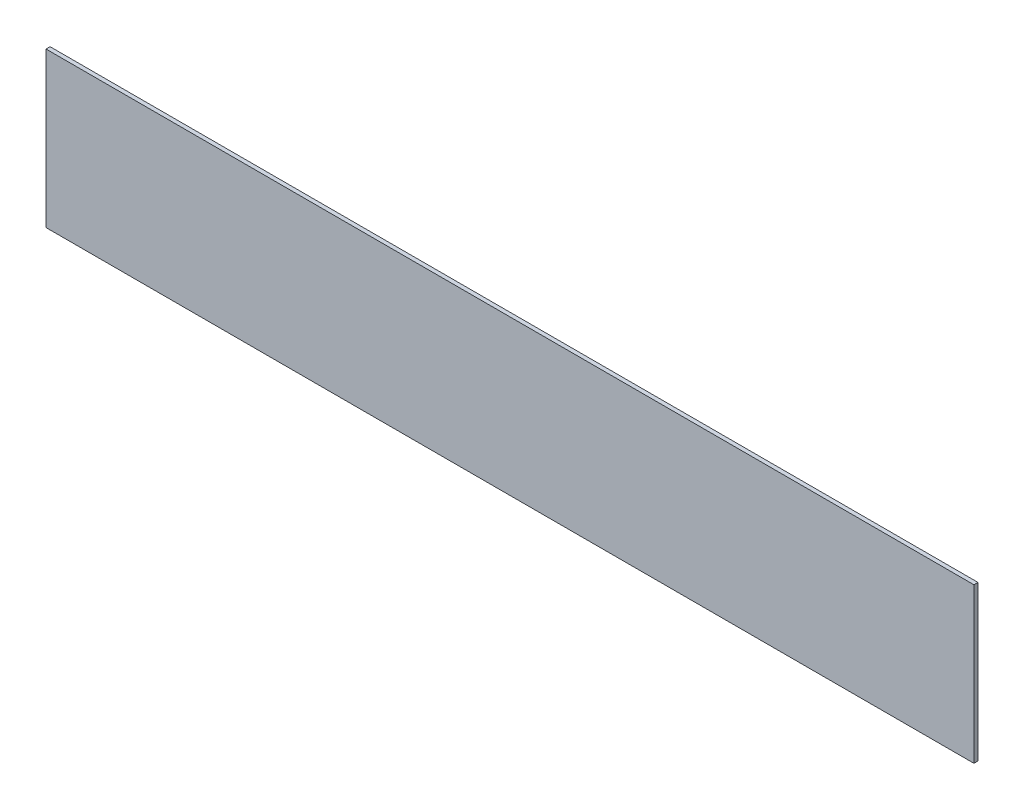
ISO-10303-21;
HEADER;
FILE_DESCRIPTION(('STEP AP214'),'2;1');
FILE_NAME('part.step','',(''),(''),'','','');
FILE_SCHEMA(('AUTOMOTIVE_DESIGN { 1 0 10303 214 1 1 1 1 }'));
ENDSEC;
DATA;
#1=APPLICATION_CONTEXT('core data for automotive mechanical design processes');
#2=APPLICATION_PROTOCOL_DEFINITION('international standard','automotive_design',2000,#1);
#3=PRODUCT_CONTEXT('',#1,'mechanical');
#4=PRODUCT('Part','Part','',(#3));
#5=PRODUCT_RELATED_PRODUCT_CATEGORY('part','',(#4));
#6=PRODUCT_DEFINITION_FORMATION('','',#4);
#7=PRODUCT_DEFINITION_CONTEXT('part definition',#1,'design');
#8=PRODUCT_DEFINITION('design','',#6,#7);
#9=PRODUCT_DEFINITION_SHAPE('','',#8);
#10=(LENGTH_UNIT() NAMED_UNIT(*) SI_UNIT(.MILLI.,.METRE.));
#11=(NAMED_UNIT(*) PLANE_ANGLE_UNIT() SI_UNIT($,.RADIAN.));
#12=(NAMED_UNIT(*) SI_UNIT($,.STERADIAN.) SOLID_ANGLE_UNIT());
#13=UNCERTAINTY_MEASURE_WITH_UNIT(LENGTH_MEASURE(1.E-05),#10,'distance_accuracy_value','');
#14=(GEOMETRIC_REPRESENTATION_CONTEXT(3) GLOBAL_UNCERTAINTY_ASSIGNED_CONTEXT((#13)) GLOBAL_UNIT_ASSIGNED_CONTEXT((#10,
#11,#12)) REPRESENTATION_CONTEXT('',''));
#15=CARTESIAN_POINT('',(0.,0.,0.));
#16=DIRECTION('',(0.,0.,1.));
#17=DIRECTION('',(1.,0.,0.));
#18=AXIS2_PLACEMENT_3D('',#15,#16,#17);
#19=CARTESIAN_POINT('',(228.6,38.1,2.));
#20=DIRECTION('',(-1.,0.,0.));
#21=DIRECTION('',(0.,0.,1.));
#22=AXIS2_PLACEMENT_3D('',#19,#20,#21);
#23=PLANE('',#22);
#24=DIRECTION('',(0.,1.,0.));
#25=VECTOR('',#24,1.);
#26=CARTESIAN_POINT('',(228.6,38.1,0.));
#27=LINE('',#26,#25);
#28=CARTESIAN_POINT('',(228.6,-38.1,0.));
#29=VERTEX_POINT('',#28);
#30=CARTESIAN_POINT('',(228.6,38.1,0.));
#31=VERTEX_POINT('',#30);
#32=EDGE_CURVE('E98',#29,#31,#27,.T.);
#33=ORIENTED_EDGE('',*,*,#32,.T.);
#34=DIRECTION('',(0.,0.,-1.));
#35=VECTOR('',#34,1.);
#36=CARTESIAN_POINT('',(228.6,38.1,2.));
#37=LINE('',#36,#35);
#38=CARTESIAN_POINT('',(228.6,38.1,2.));
#39=VERTEX_POINT('',#38);
#40=EDGE_CURVE('E11',#39,#31,#37,.T.);
#41=ORIENTED_EDGE('',*,*,#40,.F.);
#42=DIRECTION('',(0.,1.,0.));
#43=VECTOR('',#42,1.);
#44=CARTESIAN_POINT('',(228.6,38.1,2.));
#45=LINE('',#44,#43);
#46=CARTESIAN_POINT('',(228.6,-38.1,2.));
#47=VERTEX_POINT('',#46);
#48=EDGE_CURVE('E86',#47,#39,#45,.T.);
#49=ORIENTED_EDGE('',*,*,#48,.F.);
#50=DIRECTION('',(0.,0.,-1.));
#51=VECTOR('',#50,1.);
#52=CARTESIAN_POINT('',(228.6,-38.1,2.));
#53=LINE('',#52,#51);
#54=EDGE_CURVE('E94',#47,#29,#53,.T.);
#55=ORIENTED_EDGE('',*,*,#54,.T.);
#56=EDGE_LOOP('',(#33,#41,#49,#55));
#57=FACE_BOUND('',#56,.T.);
#58=ADVANCED_FACE('F35',(#57),#23,.F.);
#59=CARTESIAN_POINT('',(-228.6,38.1,2.));
#60=DIRECTION('',(0.,-1.,0.));
#61=DIRECTION('',(0.,0.,-1.));
#62=AXIS2_PLACEMENT_3D('',#59,#60,#61);
#63=PLANE('',#62);
#64=DIRECTION('',(-1.,0.,0.));
#65=VECTOR('',#64,1.);
#66=CARTESIAN_POINT('',(-228.6,38.1,0.));
#67=LINE('',#66,#65);
#68=CARTESIAN_POINT('',(-228.6,38.1,0.));
#69=VERTEX_POINT('',#68);
#70=EDGE_CURVE('E90',#31,#69,#67,.T.);
#71=ORIENTED_EDGE('',*,*,#70,.T.);
#72=DIRECTION('',(0.,0.,-1.));
#73=VECTOR('',#72,1.);
#74=CARTESIAN_POINT('',(-228.6,38.1,2.));
#75=LINE('',#74,#73);
#76=CARTESIAN_POINT('',(-228.6,38.1,2.));
#77=VERTEX_POINT('',#76);
#78=EDGE_CURVE('E43',#77,#69,#75,.T.);
#79=ORIENTED_EDGE('',*,*,#78,.F.);
#80=DIRECTION('',(-1.,0.,0.));
#81=VECTOR('',#80,1.);
#82=CARTESIAN_POINT('',(-228.6,38.1,2.));
#83=LINE('',#82,#81);
#84=EDGE_CURVE('E81',#39,#77,#83,.T.);
#85=ORIENTED_EDGE('',*,*,#84,.F.);
#86=ORIENTED_EDGE('',*,*,#40,.T.);
#87=EDGE_LOOP('',(#71,#79,#85,#86));
#88=FACE_BOUND('',#87,.T.);
#89=ADVANCED_FACE('F89',(#88),#63,.F.);
#90=CARTESIAN_POINT('',(-228.6,38.1,2.));
#91=DIRECTION('',(1.,0.,0.));
#92=DIRECTION('',(0.,0.,-1.));
#93=AXIS2_PLACEMENT_3D('',#90,#91,#92);
#94=PLANE('',#93);
#95=DIRECTION('',(0.,-1.,0.));
#96=VECTOR('',#95,1.);
#97=CARTESIAN_POINT('',(-228.6,38.1,0.));
#98=LINE('',#97,#96);
#99=CARTESIAN_POINT('',(-228.6,-38.1,0.));
#100=VERTEX_POINT('',#99);
#101=EDGE_CURVE('E68',#69,#100,#98,.T.);
#102=ORIENTED_EDGE('',*,*,#101,.T.);
#103=DIRECTION('',(0.,0.,-1.));
#104=VECTOR('',#103,1.);
#105=CARTESIAN_POINT('',(-228.6,-38.1,2.));
#106=LINE('',#105,#104);
#107=CARTESIAN_POINT('',(-228.6,-38.1,2.));
#108=VERTEX_POINT('',#107);
#109=EDGE_CURVE('E91',#108,#100,#106,.T.);
#110=ORIENTED_EDGE('',*,*,#109,.F.);
#111=DIRECTION('',(0.,-1.,0.));
#112=VECTOR('',#111,1.);
#113=CARTESIAN_POINT('',(-228.6,38.1,2.));
#114=LINE('',#113,#112);
#115=EDGE_CURVE('E84',#77,#108,#114,.T.);
#116=ORIENTED_EDGE('',*,*,#115,.F.);
#117=ORIENTED_EDGE('',*,*,#78,.T.);
#118=EDGE_LOOP('',(#102,#110,#116,#117));
#119=FACE_BOUND('',#118,.T.);
#120=ADVANCED_FACE('F92',(#119),#94,.F.);
#121=CARTESIAN_POINT('',(-228.6,-38.1,2.));
#122=DIRECTION('',(0.,1.,0.));
#123=DIRECTION('',(0.,0.,1.));
#124=AXIS2_PLACEMENT_3D('',#121,#122,#123);
#125=PLANE('',#124);
#126=DIRECTION('',(1.,0.,0.));
#127=VECTOR('',#126,1.);
#128=CARTESIAN_POINT('',(-228.6,-38.1,0.));
#129=LINE('',#128,#127);
#130=EDGE_CURVE('E74',#100,#29,#129,.T.);
#131=ORIENTED_EDGE('',*,*,#130,.T.);
#132=ORIENTED_EDGE('',*,*,#54,.F.);
#133=DIRECTION('',(1.,0.,0.));
#134=VECTOR('',#133,1.);
#135=CARTESIAN_POINT('',(-228.6,-38.1,2.));
#136=LINE('',#135,#134);
#137=EDGE_CURVE('E51',#108,#47,#136,.T.);
#138=ORIENTED_EDGE('',*,*,#137,.F.);
#139=ORIENTED_EDGE('',*,*,#109,.T.);
#140=EDGE_LOOP('',(#131,#132,#138,#139));
#141=FACE_BOUND('',#140,.T.);
#142=ADVANCED_FACE('F105',(#141),#125,.F.);
#143=CARTESIAN_POINT('',(0.,0.,2.));
#144=DIRECTION('',(0.,0.,1.));
#145=DIRECTION('',(1.,0.,0.));
#146=AXIS2_PLACEMENT_3D('',#143,#144,#145);
#147=PLANE('',#146);
#148=ORIENTED_EDGE('',*,*,#48,.T.);
#149=ORIENTED_EDGE('',*,*,#84,.T.);
#150=ORIENTED_EDGE('',*,*,#115,.T.);
#151=ORIENTED_EDGE('',*,*,#137,.T.);
#152=EDGE_LOOP('',(#148,#149,#150,#151));
#153=FACE_BOUND('',#152,.T.);
#154=ADVANCED_FACE('F82',(#153),#147,.T.);
#155=CARTESIAN_POINT('',(0.,0.,0.));
#156=DIRECTION('',(0.,0.,1.));
#157=DIRECTION('',(1.,0.,0.));
#158=AXIS2_PLACEMENT_3D('',#155,#156,#157);
#159=PLANE('',#158);
#160=ORIENTED_EDGE('',*,*,#32,.F.);
#161=ORIENTED_EDGE('',*,*,#130,.F.);
#162=ORIENTED_EDGE('',*,*,#101,.F.);
#163=ORIENTED_EDGE('',*,*,#70,.F.);
#164=EDGE_LOOP('',(#160,#161,#162,#163));
#165=FACE_BOUND('',#164,.T.);
#166=ADVANCED_FACE('F108',(#165),#159,.F.);
#167=CLOSED_SHELL('',(#58,#89,#120,#142,#154,#166));
#168=MANIFOLD_SOLID_BREP('B2',#167);
#169=ADVANCED_BREP_SHAPE_REPRESENTATION('',(#18,#168),#14);
#170=SHAPE_DEFINITION_REPRESENTATION(#9,#169);
ENDSEC;
END-ISO-10303-21;
